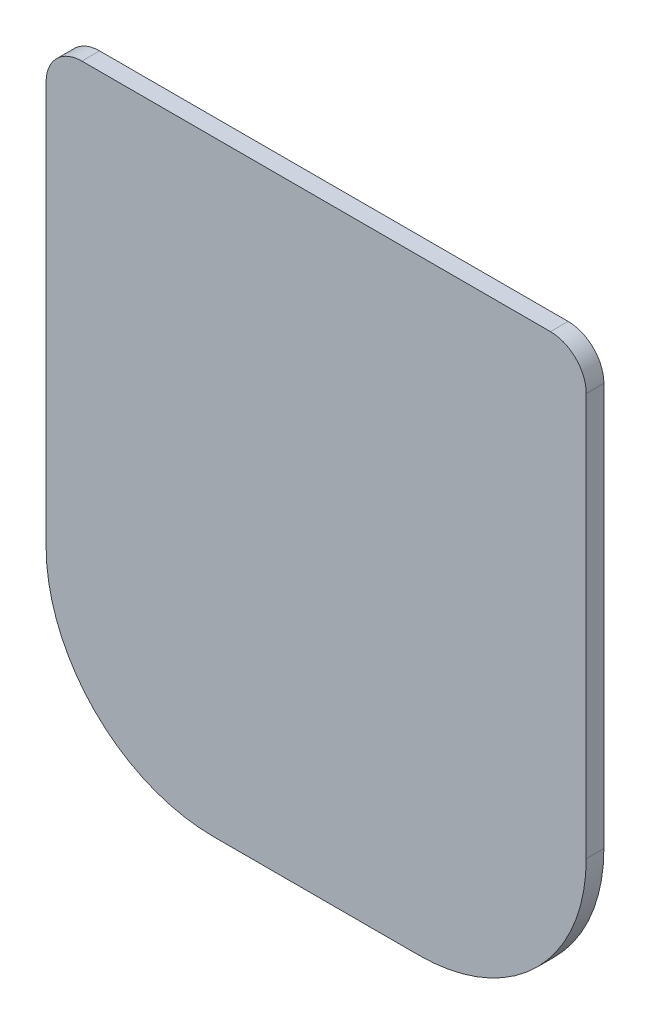
ISO-10303-21;
HEADER;
FILE_DESCRIPTION(('STEP AP214'),'2;1');
FILE_NAME('part.step','',(''),(''),'','','');
FILE_SCHEMA(('AUTOMOTIVE_DESIGN { 1 0 10303 214 1 1 1 1 }'));
ENDSEC;
DATA;
#1=APPLICATION_CONTEXT('core data for automotive mechanical design processes');
#2=APPLICATION_PROTOCOL_DEFINITION('international standard','automotive_design',2000,#1);
#3=PRODUCT_CONTEXT('',#1,'mechanical');
#4=PRODUCT('Part','Part','',(#3));
#5=PRODUCT_RELATED_PRODUCT_CATEGORY('part','',(#4));
#6=PRODUCT_DEFINITION_FORMATION('','',#4);
#7=PRODUCT_DEFINITION_CONTEXT('part definition',#1,'design');
#8=PRODUCT_DEFINITION('design','',#6,#7);
#9=PRODUCT_DEFINITION_SHAPE('','',#8);
#10=(LENGTH_UNIT() NAMED_UNIT(*) SI_UNIT(.MILLI.,.METRE.));
#11=(NAMED_UNIT(*) PLANE_ANGLE_UNIT() SI_UNIT($,.RADIAN.));
#12=(NAMED_UNIT(*) SI_UNIT($,.STERADIAN.) SOLID_ANGLE_UNIT());
#13=UNCERTAINTY_MEASURE_WITH_UNIT(LENGTH_MEASURE(1.E-05),#10,'distance_accuracy_value','');
#14=(GEOMETRIC_REPRESENTATION_CONTEXT(3) GLOBAL_UNCERTAINTY_ASSIGNED_CONTEXT((#13)) GLOBAL_UNIT_ASSIGNED_CONTEXT((#10,
#11,#12)) REPRESENTATION_CONTEXT('',''));
#15=CARTESIAN_POINT('',(0.,0.,0.));
#16=DIRECTION('',(0.,0.,1.));
#17=DIRECTION('',(1.,0.,0.));
#18=AXIS2_PLACEMENT_3D('',#15,#16,#17);
#19=CARTESIAN_POINT('',(-57.,58.81,4.3));
#20=DIRECTION('',(0.,0.,-1.));
#21=DIRECTION('',(-1.,0.,0.));
#22=AXIS2_PLACEMENT_3D('',#19,#20,#21);
#23=CYLINDRICAL_SURFACE('',#22,8.7);
#24=CARTESIAN_POINT('',(-57.,58.81,0.));
#25=DIRECTION('',(0.,0.,1.));
#26=DIRECTION('',(-1.,0.,0.));
#27=AXIS2_PLACEMENT_3D('',#24,#25,#26);
#28=CIRCLE('',#27,8.7);
#29=CARTESIAN_POINT('',(-57.,67.51,0.));
#30=VERTEX_POINT('',#29);
#31=CARTESIAN_POINT('',(-65.7,58.81,0.));
#32=VERTEX_POINT('',#31);
#33=EDGE_CURVE('E140',#30,#32,#28,.T.);
#34=ORIENTED_EDGE('',*,*,#33,.T.);
#35=DIRECTION('',(0.,0.,-1.));
#36=VECTOR('',#35,1.);
#37=CARTESIAN_POINT('',(-65.7,58.81,4.3));
#38=LINE('',#37,#36);
#39=CARTESIAN_POINT('',(-65.7,58.81,4.3));
#40=VERTEX_POINT('',#39);
#41=EDGE_CURVE('E11',#40,#32,#38,.T.);
#42=ORIENTED_EDGE('',*,*,#41,.F.);
#43=CARTESIAN_POINT('',(-57.,58.81,4.3));
#44=DIRECTION('',(0.,0.,1.));
#45=DIRECTION('',(-1.,0.,0.));
#46=AXIS2_PLACEMENT_3D('',#43,#44,#45);
#47=CIRCLE('',#46,8.7);
#48=CARTESIAN_POINT('',(-57.,67.51,4.3));
#49=VERTEX_POINT('',#48);
#50=EDGE_CURVE('E163',#49,#40,#47,.T.);
#51=ORIENTED_EDGE('',*,*,#50,.F.);
#52=DIRECTION('',(0.,0.,-1.));
#53=VECTOR('',#52,1.);
#54=CARTESIAN_POINT('',(-57.,67.51,4.3));
#55=LINE('',#54,#53);
#56=EDGE_CURVE('E136',#49,#30,#55,.T.);
#57=ORIENTED_EDGE('',*,*,#56,.T.);
#58=EDGE_LOOP('',(#34,#42,#51,#57));
#59=FACE_BOUND('',#58,.T.);
#60=ADVANCED_FACE('F39',(#59),#23,.T.);
#61=CARTESIAN_POINT('',(-65.7,58.81,4.3));
#62=DIRECTION('',(1.,0.,0.));
#63=DIRECTION('',(0.,1.,0.));
#64=AXIS2_PLACEMENT_3D('',#61,#62,#63);
#65=PLANE('',#64);
#66=DIRECTION('',(0.,-1.,0.));
#67=VECTOR('',#66,1.);
#68=CARTESIAN_POINT('',(-65.7,58.81,0.));
#69=LINE('',#68,#67);
#70=CARTESIAN_POINT('',(-65.7,-39.19,0.));
#71=VERTEX_POINT('',#70);
#72=EDGE_CURVE('E144',#32,#71,#69,.T.);
#73=ORIENTED_EDGE('',*,*,#72,.T.);
#74=DIRECTION('',(0.,0.,-1.));
#75=VECTOR('',#74,1.);
#76=CARTESIAN_POINT('',(-65.7,-39.19,4.3));
#77=LINE('',#76,#75);
#78=CARTESIAN_POINT('',(-65.7,-39.19,4.3));
#79=VERTEX_POINT('',#78);
#80=EDGE_CURVE('E48',#79,#71,#77,.T.);
#81=ORIENTED_EDGE('',*,*,#80,.F.);
#82=DIRECTION('',(0.,-1.,0.));
#83=VECTOR('',#82,1.);
#84=CARTESIAN_POINT('',(-65.7,58.81,4.3));
#85=LINE('',#84,#83);
#86=EDGE_CURVE('E99',#40,#79,#85,.T.);
#87=ORIENTED_EDGE('',*,*,#86,.F.);
#88=ORIENTED_EDGE('',*,*,#41,.T.);
#89=EDGE_LOOP('',(#73,#81,#87,#88));
#90=FACE_BOUND('',#89,.T.);
#91=ADVANCED_FACE('F208',(#90),#65,.F.);
#92=CARTESIAN_POINT('',(-25.,-39.19,4.3));
#93=DIRECTION('',(0.,0.,-1.));
#94=DIRECTION('',(-1.,0.,0.));
#95=AXIS2_PLACEMENT_3D('',#92,#93,#94);
#96=CYLINDRICAL_SURFACE('',#95,40.7);
#97=CARTESIAN_POINT('',(-25.,-39.19,0.));
#98=DIRECTION('',(0.,0.,1.));
#99=DIRECTION('',(1.,0.,0.));
#100=AXIS2_PLACEMENT_3D('',#97,#98,#99);
#101=CIRCLE('',#100,40.7);
#102=CARTESIAN_POINT('',(-25.,-79.89,0.));
#103=VERTEX_POINT('',#102);
#104=EDGE_CURVE('E147',#71,#103,#101,.T.);
#105=ORIENTED_EDGE('',*,*,#104,.T.);
#106=DIRECTION('',(0.,0.,-1.));
#107=VECTOR('',#106,1.);
#108=CARTESIAN_POINT('',(-25.,-79.89,4.3));
#109=LINE('',#108,#107);
#110=CARTESIAN_POINT('',(-25.,-79.89,4.3));
#111=VERTEX_POINT('',#110);
#112=EDGE_CURVE('E174',#111,#103,#109,.T.);
#113=ORIENTED_EDGE('',*,*,#112,.F.);
#114=CARTESIAN_POINT('',(-25.,-39.19,4.3));
#115=DIRECTION('',(0.,0.,1.));
#116=DIRECTION('',(1.,0.,0.));
#117=AXIS2_PLACEMENT_3D('',#114,#115,#116);
#118=CIRCLE('',#117,40.7);
#119=EDGE_CURVE('E184',#79,#111,#118,.T.);
#120=ORIENTED_EDGE('',*,*,#119,.F.);
#121=ORIENTED_EDGE('',*,*,#80,.T.);
#122=EDGE_LOOP('',(#105,#113,#120,#121));
#123=FACE_BOUND('',#122,.T.);
#124=ADVANCED_FACE('F182',(#123),#96,.T.);
#125=CARTESIAN_POINT('',(0.49999999999999,-79.89,4.3));
#126=DIRECTION('',(0.,1.,0.));
#127=DIRECTION('',(0.,0.,1.));
#128=AXIS2_PLACEMENT_3D('',#125,#126,#127);
#129=PLANE('',#128);
#130=DIRECTION('',(1.,0.,0.));
#131=VECTOR('',#130,1.);
#132=CARTESIAN_POINT('',(0.49999999999999,-79.89,0.));
#133=LINE('',#132,#131);
#134=CARTESIAN_POINT('',(25.,-79.89,0.));
#135=VERTEX_POINT('',#134);
#136=EDGE_CURVE('E151',#103,#135,#133,.T.);
#137=ORIENTED_EDGE('',*,*,#136,.T.);
#138=DIRECTION('',(0.,0.,-1.));
#139=VECTOR('',#138,1.);
#140=CARTESIAN_POINT('',(25.,-79.89,4.3));
#141=LINE('',#140,#139);
#142=CARTESIAN_POINT('',(25.,-79.89,4.3));
#143=VERTEX_POINT('',#142);
#144=EDGE_CURVE('E170',#143,#135,#141,.T.);
#145=ORIENTED_EDGE('',*,*,#144,.F.);
#146=DIRECTION('',(1.,0.,0.));
#147=VECTOR('',#146,1.);
#148=CARTESIAN_POINT('',(-25.,-79.89,4.3));
#149=LINE('',#148,#147);
#150=EDGE_CURVE('E196',#111,#143,#149,.T.);
#151=ORIENTED_EDGE('',*,*,#150,.F.);
#152=ORIENTED_EDGE('',*,*,#112,.T.);
#153=EDGE_LOOP('',(#137,#145,#151,#152));
#154=FACE_BOUND('',#153,.T.);
#155=ADVANCED_FACE('F191',(#154),#129,.F.);
#156=CARTESIAN_POINT('',(25.,-39.19,4.3));
#157=DIRECTION('',(0.,0.,-1.));
#158=DIRECTION('',(-1.,0.,0.));
#159=AXIS2_PLACEMENT_3D('',#156,#157,#158);
#160=CYLINDRICAL_SURFACE('',#159,40.7);
#161=CARTESIAN_POINT('',(25.,-39.19,0.));
#162=DIRECTION('',(0.,0.,1.));
#163=DIRECTION('',(1.,0.,0.));
#164=AXIS2_PLACEMENT_3D('',#161,#162,#163);
#165=CIRCLE('',#164,40.7);
#166=CARTESIAN_POINT('',(65.7,-39.19,0.));
#167=VERTEX_POINT('',#166);
#168=EDGE_CURVE('E154',#135,#167,#165,.T.);
#169=ORIENTED_EDGE('',*,*,#168,.T.);
#170=DIRECTION('',(0.,0.,-1.));
#171=VECTOR('',#170,1.);
#172=CARTESIAN_POINT('',(65.7,-39.19,4.3));
#173=LINE('',#172,#171);
#174=CARTESIAN_POINT('',(65.7,-39.19,4.3));
#175=VERTEX_POINT('',#174);
#176=EDGE_CURVE('E129',#175,#167,#173,.T.);
#177=ORIENTED_EDGE('',*,*,#176,.F.);
#178=CARTESIAN_POINT('',(25.,-39.19,4.3));
#179=DIRECTION('',(0.,0.,1.));
#180=DIRECTION('',(1.,0.,0.));
#181=AXIS2_PLACEMENT_3D('',#178,#179,#180);
#182=CIRCLE('',#181,40.7);
#183=EDGE_CURVE('E118',#143,#175,#182,.T.);
#184=ORIENTED_EDGE('',*,*,#183,.F.);
#185=ORIENTED_EDGE('',*,*,#144,.T.);
#186=EDGE_LOOP('',(#169,#177,#184,#185));
#187=FACE_BOUND('',#186,.T.);
#188=ADVANCED_FACE('F194',(#187),#160,.T.);
#189=CARTESIAN_POINT('',(65.7,-39.19,4.3));
#190=DIRECTION('',(-1.,0.,0.));
#191=DIRECTION('',(0.,0.,1.));
#192=AXIS2_PLACEMENT_3D('',#189,#190,#191);
#193=PLANE('',#192);
#194=DIRECTION('',(0.,1.,0.));
#195=VECTOR('',#194,1.);
#196=CARTESIAN_POINT('',(65.7,-39.19,0.));
#197=LINE('',#196,#195);
#198=CARTESIAN_POINT('',(65.7,58.81,0.));
#199=VERTEX_POINT('',#198);
#200=EDGE_CURVE('E127',#167,#199,#197,.T.);
#201=ORIENTED_EDGE('',*,*,#200,.T.);
#202=DIRECTION('',(0.,0.,-1.));
#203=VECTOR('',#202,1.);
#204=CARTESIAN_POINT('',(65.7,58.81,4.3));
#205=LINE('',#204,#203);
#206=CARTESIAN_POINT('',(65.7,58.81,4.3));
#207=VERTEX_POINT('',#206);
#208=EDGE_CURVE('E124',#207,#199,#205,.T.);
#209=ORIENTED_EDGE('',*,*,#208,.F.);
#210=DIRECTION('',(0.,1.,0.));
#211=VECTOR('',#210,1.);
#212=CARTESIAN_POINT('',(65.7,-39.19,4.3));
#213=LINE('',#212,#211);
#214=EDGE_CURVE('E112',#175,#207,#213,.T.);
#215=ORIENTED_EDGE('',*,*,#214,.F.);
#216=ORIENTED_EDGE('',*,*,#176,.T.);
#217=EDGE_LOOP('',(#201,#209,#215,#216));
#218=FACE_BOUND('',#217,.T.);
#219=ADVANCED_FACE('F125',(#218),#193,.F.);
#220=CARTESIAN_POINT('',(57.,58.81,4.3));
#221=DIRECTION('',(0.,0.,-1.));
#222=DIRECTION('',(-1.,0.,0.));
#223=AXIS2_PLACEMENT_3D('',#220,#221,#222);
#224=CYLINDRICAL_SURFACE('',#223,8.7);
#225=CARTESIAN_POINT('',(57.,58.81,0.));
#226=DIRECTION('',(0.,0.,1.));
#227=DIRECTION('',(1.,0.,0.));
#228=AXIS2_PLACEMENT_3D('',#225,#226,#227);
#229=CIRCLE('',#228,8.7);
#230=CARTESIAN_POINT('',(57.,67.51,0.));
#231=VERTEX_POINT('',#230);
#232=EDGE_CURVE('E85',#199,#231,#229,.T.);
#233=ORIENTED_EDGE('',*,*,#232,.T.);
#234=DIRECTION('',(0.,0.,-1.));
#235=VECTOR('',#234,1.);
#236=CARTESIAN_POINT('',(57.,67.51,4.3));
#237=LINE('',#236,#235);
#238=CARTESIAN_POINT('',(57.,67.51,4.3));
#239=VERTEX_POINT('',#238);
#240=EDGE_CURVE('E130',#239,#231,#237,.T.);
#241=ORIENTED_EDGE('',*,*,#240,.F.);
#242=CARTESIAN_POINT('',(57.,58.81,4.3));
#243=DIRECTION('',(0.,0.,1.));
#244=DIRECTION('',(1.,0.,0.));
#245=AXIS2_PLACEMENT_3D('',#242,#243,#244);
#246=CIRCLE('',#245,8.7);
#247=EDGE_CURVE('E116',#207,#239,#246,.T.);
#248=ORIENTED_EDGE('',*,*,#247,.F.);
#249=ORIENTED_EDGE('',*,*,#208,.T.);
#250=EDGE_LOOP('',(#233,#241,#248,#249));
#251=FACE_BOUND('',#250,.T.);
#252=ADVANCED_FACE('F132',(#251),#224,.T.);
#253=CARTESIAN_POINT('',(57.,67.51,4.3));
#254=DIRECTION('',(0.,-1.,0.));
#255=DIRECTION('',(0.,0.,-1.));
#256=AXIS2_PLACEMENT_3D('',#253,#254,#255);
#257=PLANE('',#256);
#258=DIRECTION('',(-1.,0.,0.));
#259=VECTOR('',#258,1.);
#260=CARTESIAN_POINT('',(57.,67.51,0.));
#261=LINE('',#260,#259);
#262=EDGE_CURVE('E91',#231,#30,#261,.T.);
#263=ORIENTED_EDGE('',*,*,#262,.T.);
#264=ORIENTED_EDGE('',*,*,#56,.F.);
#265=DIRECTION('',(-1.,0.,0.));
#266=VECTOR('',#265,1.);
#267=CARTESIAN_POINT('',(57.,67.51,4.3));
#268=LINE('',#267,#266);
#269=EDGE_CURVE('E56',#239,#49,#268,.T.);
#270=ORIENTED_EDGE('',*,*,#269,.F.);
#271=ORIENTED_EDGE('',*,*,#240,.T.);
#272=EDGE_LOOP('',(#263,#264,#270,#271));
#273=FACE_BOUND('',#272,.T.);
#274=ADVANCED_FACE('F224',(#273),#257,.F.);
#275=CARTESIAN_POINT('',(-57.,58.81,4.3));
#276=DIRECTION('',(0.,0.,-1.));
#277=DIRECTION('',(-1.,0.,0.));
#278=AXIS2_PLACEMENT_3D('',#275,#276,#277);
#279=PLANE('',#278);
#280=ORIENTED_EDGE('',*,*,#50,.T.);
#281=ORIENTED_EDGE('',*,*,#86,.T.);
#282=ORIENTED_EDGE('',*,*,#119,.T.);
#283=ORIENTED_EDGE('',*,*,#150,.T.);
#284=ORIENTED_EDGE('',*,*,#183,.T.);
#285=ORIENTED_EDGE('',*,*,#214,.T.);
#286=ORIENTED_EDGE('',*,*,#247,.T.);
#287=ORIENTED_EDGE('',*,*,#269,.T.);
#288=EDGE_LOOP('',(#280,#281,#282,#283,#284,#285,#286,#287));
#289=FACE_BOUND('',#288,.T.);
#290=ADVANCED_FACE('F114',(#289),#279,.F.);
#291=CARTESIAN_POINT('',(-57.,58.81,0.));
#292=DIRECTION('',(0.,0.,-1.));
#293=DIRECTION('',(-1.,0.,0.));
#294=AXIS2_PLACEMENT_3D('',#291,#292,#293);
#295=PLANE('',#294);
#296=ORIENTED_EDGE('',*,*,#33,.F.);
#297=ORIENTED_EDGE('',*,*,#262,.F.);
#298=ORIENTED_EDGE('',*,*,#232,.F.);
#299=ORIENTED_EDGE('',*,*,#200,.F.);
#300=ORIENTED_EDGE('',*,*,#168,.F.);
#301=ORIENTED_EDGE('',*,*,#136,.F.);
#302=ORIENTED_EDGE('',*,*,#104,.F.);
#303=ORIENTED_EDGE('',*,*,#72,.F.);
#304=EDGE_LOOP('',(#296,#297,#298,#299,#300,#301,#302,#303));
#305=FACE_BOUND('',#304,.T.);
#306=ADVANCED_FACE('F187',(#305),#295,.T.);
#307=CLOSED_SHELL('',(#60,#91,#124,#155,#188,#219,#252,#274,#290,#306));
#308=MANIFOLD_SOLID_BREP('B2',#307);
#309=ADVANCED_BREP_SHAPE_REPRESENTATION('',(#18,#308),#14);
#310=SHAPE_DEFINITION_REPRESENTATION(#9,#309);
ENDSEC;
END-ISO-10303-21;
